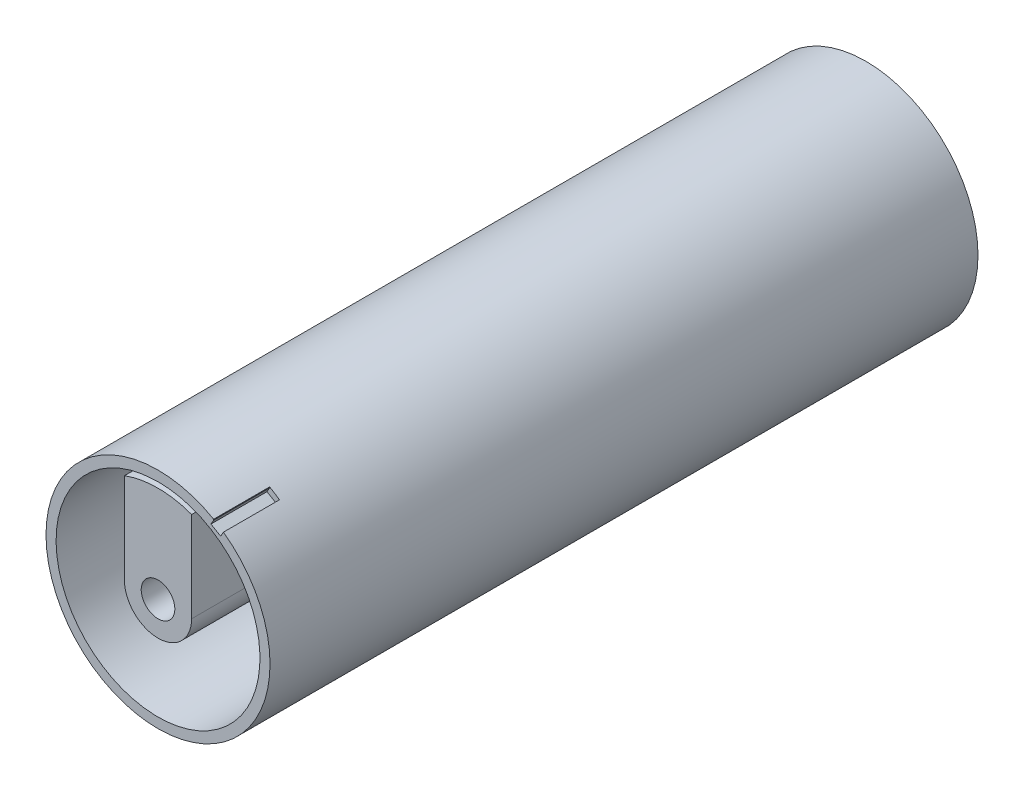
ISO-10303-21;
HEADER;
FILE_DESCRIPTION(('STEP AP214'),'2;1');
FILE_NAME('part.step','',(''),(''),'','','');
FILE_SCHEMA(('AUTOMOTIVE_DESIGN { 1 0 10303 214 1 1 1 1 }'));
ENDSEC;
DATA;
#1=APPLICATION_CONTEXT('core data for automotive mechanical design processes');
#2=APPLICATION_PROTOCOL_DEFINITION('international standard','automotive_design',2000,#1);
#3=PRODUCT_CONTEXT('',#1,'mechanical');
#4=PRODUCT('Part','Part','',(#3));
#5=PRODUCT_RELATED_PRODUCT_CATEGORY('part','',(#4));
#6=PRODUCT_DEFINITION_FORMATION('','',#4);
#7=PRODUCT_DEFINITION_CONTEXT('part definition',#1,'design');
#8=PRODUCT_DEFINITION('design','',#6,#7);
#9=PRODUCT_DEFINITION_SHAPE('','',#8);
#10=(LENGTH_UNIT() NAMED_UNIT(*) SI_UNIT(.MILLI.,.METRE.));
#11=(NAMED_UNIT(*) PLANE_ANGLE_UNIT() SI_UNIT($,.RADIAN.));
#12=(NAMED_UNIT(*) SI_UNIT($,.STERADIAN.) SOLID_ANGLE_UNIT());
#13=UNCERTAINTY_MEASURE_WITH_UNIT(LENGTH_MEASURE(1.E-05),#10,'distance_accuracy_value','');
#14=(GEOMETRIC_REPRESENTATION_CONTEXT(3) GLOBAL_UNCERTAINTY_ASSIGNED_CONTEXT((#13)) GLOBAL_UNIT_ASSIGNED_CONTEXT((#10,
#11,#12)) REPRESENTATION_CONTEXT('',''));
#15=CARTESIAN_POINT('',(0.,0.,0.));
#16=DIRECTION('',(0.,0.,1.));
#17=DIRECTION('',(1.,0.,0.));
#18=AXIS2_PLACEMENT_3D('',#15,#16,#17);
#19=CARTESIAN_POINT('',(0.,0.,41.2802756522968));
#20=DIRECTION('',(0.,0.,1.));
#21=DIRECTION('',(1.,0.,0.));
#22=AXIS2_PLACEMENT_3D('',#19,#20,#21);
#23=CYLINDRICAL_SURFACE('',#22,6.);
#24=DIRECTION('',(0.,0.,1.));
#25=VECTOR('',#24,1.);
#26=CARTESIAN_POINT('',(-6.,0.,41.2802756522968));
#27=LINE('',#26,#25);
#28=CARTESIAN_POINT('',(-6.,0.,67.8));
#29=VERTEX_POINT('',#28);
#30=CARTESIAN_POINT('',(-6.,0.,126.4));
#31=VERTEX_POINT('',#30);
#32=EDGE_CURVE('E102',#29,#31,#27,.T.);
#33=ORIENTED_EDGE('',*,*,#32,.F.);
#34=CARTESIAN_POINT('',(0.,0.,67.8));
#35=DIRECTION('',(0.,0.,-1.));
#36=DIRECTION('',(-1.,0.,0.));
#37=AXIS2_PLACEMENT_3D('',#34,#35,#36);
#38=CIRCLE('',#37,6.);
#39=CARTESIAN_POINT('',(6.,0.,67.8));
#40=VERTEX_POINT('',#39);
#41=EDGE_CURVE('E92',#29,#40,#38,.F.);
#42=ORIENTED_EDGE('',*,*,#41,.T.);
#43=DIRECTION('',(0.,0.,1.));
#44=VECTOR('',#43,1.);
#45=CARTESIAN_POINT('',(6.,0.,41.2802756522968));
#46=LINE('',#45,#44);
#47=CARTESIAN_POINT('',(6.,0.,126.4));
#48=VERTEX_POINT('',#47);
#49=EDGE_CURVE('E57',#40,#48,#46,.T.);
#50=ORIENTED_EDGE('',*,*,#49,.T.);
#51=CARTESIAN_POINT('',(0.,0.,126.4));
#52=DIRECTION('',(0.,0.,1.));
#53=DIRECTION('',(-1.,0.,0.));
#54=AXIS2_PLACEMENT_3D('',#51,#52,#53);
#55=CIRCLE('',#54,6.);
#56=EDGE_CURVE('E104',#31,#48,#55,.T.);
#57=ORIENTED_EDGE('',*,*,#56,.F.);
#58=EDGE_LOOP('',(#33,#42,#50,#57));
#59=FACE_BOUND('',#58,.T.);
#60=ADVANCED_FACE('F53',(#59),#23,.T.);
#61=CARTESIAN_POINT('',(-6.,16.1195533436879,41.2802756522968));
#62=DIRECTION('',(-1.,0.,0.));
#63=DIRECTION('',(0.,-1.,0.));
#64=AXIS2_PLACEMENT_3D('',#61,#62,#63);
#65=PLANE('',#64);
#66=DIRECTION('',(0.,0.,1.));
#67=VECTOR('',#66,1.);
#68=CARTESIAN_POINT('',(-6.,16.1195533436879,41.2802756522968));
#69=LINE('',#68,#67);
#70=CARTESIAN_POINT('',(-6.,16.1195533436879,67.8));
#71=VERTEX_POINT('',#70);
#72=CARTESIAN_POINT('',(-6.,16.1195533436879,126.4));
#73=VERTEX_POINT('',#72);
#74=EDGE_CURVE('E110',#71,#73,#69,.T.);
#75=ORIENTED_EDGE('',*,*,#74,.F.);
#76=DIRECTION('',(0.,-1.,0.));
#77=VECTOR('',#76,1.);
#78=CARTESIAN_POINT('',(-6.,16.1195533436879,67.8));
#79=LINE('',#78,#77);
#80=EDGE_CURVE('E96',#71,#29,#79,.T.);
#81=ORIENTED_EDGE('',*,*,#80,.T.);
#82=ORIENTED_EDGE('',*,*,#32,.T.);
#83=DIRECTION('',(0.,-1.,0.));
#84=VECTOR('',#83,1.);
#85=CARTESIAN_POINT('',(-6.,16.1195533436879,126.4));
#86=LINE('',#85,#84);
#87=EDGE_CURVE('E62',#73,#31,#86,.T.);
#88=ORIENTED_EDGE('',*,*,#87,.F.);
#89=EDGE_LOOP('',(#75,#81,#82,#88));
#90=FACE_BOUND('',#89,.T.);
#91=ADVANCED_FACE('F109',(#90),#65,.T.);
#92=CARTESIAN_POINT('',(0.,0.,41.2802756522968));
#93=DIRECTION('',(0.,0.,1.));
#94=DIRECTION('',(1.,0.,0.));
#95=AXIS2_PLACEMENT_3D('',#92,#93,#94);
#96=CYLINDRICAL_SURFACE('',#95,17.2);
#97=DIRECTION('',(0.,0.,1.));
#98=VECTOR('',#97,1.);
#99=CARTESIAN_POINT('',(6.,16.1195533436879,41.2802756522968));
#100=LINE('',#99,#98);
#101=CARTESIAN_POINT('',(6.,16.1195533436879,67.8));
#102=VERTEX_POINT('',#101);
#103=CARTESIAN_POINT('',(6.,16.1195533436879,126.4));
#104=VERTEX_POINT('',#103);
#105=EDGE_CURVE('E115',#102,#104,#100,.T.);
#106=ORIENTED_EDGE('',*,*,#105,.F.);
#107=CARTESIAN_POINT('',(0.,0.,67.8));
#108=DIRECTION('',(0.,0.,-1.));
#109=DIRECTION('',(-1.,0.,0.));
#110=AXIS2_PLACEMENT_3D('',#107,#108,#109);
#111=CIRCLE('',#110,17.2);
#112=EDGE_CURVE('E76',#102,#71,#111,.F.);
#113=ORIENTED_EDGE('',*,*,#112,.T.);
#114=ORIENTED_EDGE('',*,*,#74,.T.);
#115=CARTESIAN_POINT('',(0.,0.,126.4));
#116=DIRECTION('',(0.,0.,1.));
#117=DIRECTION('',(1.,0.,0.));
#118=AXIS2_PLACEMENT_3D('',#115,#116,#117);
#119=CIRCLE('',#118,17.2);
#120=EDGE_CURVE('E127',#104,#73,#119,.T.);
#121=ORIENTED_EDGE('',*,*,#120,.F.);
#122=EDGE_LOOP('',(#106,#113,#114,#121));
#123=FACE_BOUND('',#122,.T.);
#124=ADVANCED_FACE('F133',(#123),#96,.T.);
#125=CARTESIAN_POINT('',(6.,0.,41.2802756522968));
#126=DIRECTION('',(1.,0.,0.));
#127=DIRECTION('',(0.,1.,0.));
#128=AXIS2_PLACEMENT_3D('',#125,#126,#127);
#129=PLANE('',#128);
#130=ORIENTED_EDGE('',*,*,#49,.F.);
#131=DIRECTION('',(0.,1.,0.));
#132=VECTOR('',#131,1.);
#133=CARTESIAN_POINT('',(6.,0.,67.8));
#134=LINE('',#133,#132);
#135=EDGE_CURVE('E70',#40,#102,#134,.T.);
#136=ORIENTED_EDGE('',*,*,#135,.T.);
#137=ORIENTED_EDGE('',*,*,#105,.T.);
#138=DIRECTION('',(0.,1.,0.));
#139=VECTOR('',#138,1.);
#140=CARTESIAN_POINT('',(6.,0.,126.4));
#141=LINE('',#140,#139);
#142=EDGE_CURVE('E124',#48,#104,#141,.T.);
#143=ORIENTED_EDGE('',*,*,#142,.F.);
#144=EDGE_LOOP('',(#130,#136,#137,#143));
#145=FACE_BOUND('',#144,.T.);
#146=ADVANCED_FACE('F135',(#145),#129,.T.);
#147=CARTESIAN_POINT('',(0.,0.,41.2802756522968));
#148=DIRECTION('',(0.,0.,1.));
#149=DIRECTION('',(1.,0.,0.));
#150=AXIS2_PLACEMENT_3D('',#147,#148,#149);
#151=CYLINDRICAL_SURFACE('',#150,2.99999999999862);
#152=CARTESIAN_POINT('',(0.,0.,126.4));
#153=DIRECTION('',(0.,0.,1.));
#154=DIRECTION('',(1.,0.,0.));
#155=AXIS2_PLACEMENT_3D('',#152,#153,#154);
#156=CIRCLE('',#155,2.99999999999862);
#157=CARTESIAN_POINT('',(2.99999999999862,0.,126.4));
#158=VERTEX_POINT('',#157);
#159=EDGE_CURVE('E116',#158,#158,#156,.T.);
#160=ORIENTED_EDGE('',*,*,#159,.T.);
#161=EDGE_LOOP('',(#160));
#162=FACE_BOUND('',#161,.T.);
#163=CARTESIAN_POINT('',(0.,0.,67.8));
#164=DIRECTION('',(0.,0.,-1.));
#165=DIRECTION('',(-1.,0.,0.));
#166=AXIS2_PLACEMENT_3D('',#163,#164,#165);
#167=CIRCLE('',#166,2.99999999999862);
#168=CARTESIAN_POINT('',(-2.99999999999862,0.,67.8));
#169=VERTEX_POINT('',#168);
#170=EDGE_CURVE('E13',#169,#169,#167,.F.);
#171=ORIENTED_EDGE('',*,*,#170,.F.);
#172=EDGE_LOOP('',(#171));
#173=FACE_BOUND('',#172,.T.);
#174=ADVANCED_FACE('F141',(#162,#173),#151,.F.);
#175=CARTESIAN_POINT('',(0.,0.,126.4));
#176=DIRECTION('',(0.,0.,-1.));
#177=DIRECTION('',(-1.,0.,0.));
#178=AXIS2_PLACEMENT_3D('',#175,#176,#177);
#179=PLANE('',#178);
#180=ORIENTED_EDGE('',*,*,#159,.F.);
#181=EDGE_LOOP('',(#180));
#182=FACE_BOUND('',#181,.T.);
#183=ORIENTED_EDGE('',*,*,#56,.T.);
#184=ORIENTED_EDGE('',*,*,#142,.T.);
#185=ORIENTED_EDGE('',*,*,#120,.T.);
#186=ORIENTED_EDGE('',*,*,#87,.T.);
#187=EDGE_LOOP('',(#183,#184,#185,#186));
#188=FACE_BOUND('',#187,.T.);
#189=ADVANCED_FACE('F131',(#182,#188),#179,.F.);
#190=CARTESIAN_POINT('',(0.,0.,67.8));
#191=DIRECTION('',(0.,0.,-1.));
#192=DIRECTION('',(-1.,0.,0.));
#193=AXIS2_PLACEMENT_3D('',#190,#191,#192);
#194=PLANE('',#193);
#195=ORIENTED_EDGE('',*,*,#41,.F.);
#196=ORIENTED_EDGE('',*,*,#80,.F.);
#197=ORIENTED_EDGE('',*,*,#112,.F.);
#198=ORIENTED_EDGE('',*,*,#135,.F.);
#199=EDGE_LOOP('',(#195,#196,#197,#198));
#200=FACE_BOUND('',#199,.T.);
#201=ORIENTED_EDGE('',*,*,#170,.T.);
#202=EDGE_LOOP('',(#201));
#203=FACE_BOUND('',#202,.T.);
#204=ADVANCED_FACE('F55',(#200,#203),#194,.T.);
#205=CLOSED_SHELL('',(#60,#91,#124,#146,#174,#189,#204));
#206=MANIFOLD_SOLID_BREP('B2',#205);
#207=CARTESIAN_POINT('',(-7.43302302226797,8.1086477757043,126.4));
#208=DIRECTION('',(0.,0.,-1.));
#209=DIRECTION('',(-1.,0.,0.));
#210=AXIS2_PLACEMENT_3D('',#207,#208,#209);
#211=CYLINDRICAL_SURFACE('',#210,6.);
#212=CARTESIAN_POINT('',(-7.43302302226797,8.1086477757043,67.4));
#213=DIRECTION('',(0.,0.,-1.));
#214=DIRECTION('',(-1.,0.,0.));
#215=AXIS2_PLACEMENT_3D('',#212,#213,#214);
#216=CIRCLE('',#215,6.);
#217=CARTESIAN_POINT('',(-1.51453491696668,9.09429403446407,67.4));
#218=VERTEX_POINT('',#217);
#219=CARTESIAN_POINT('',(-3.37864682830362,3.6857489889565,67.4));
#220=VERTEX_POINT('',#219);
#221=EDGE_CURVE('E345',#218,#220,#216,.T.);
#222=ORIENTED_EDGE('',*,*,#221,.F.);
#223=DIRECTION('',(0.,0.,-1.));
#224=VECTOR('',#223,1.);
#225=CARTESIAN_POINT('',(-1.51453491696668,9.09429403446407,126.4));
#226=LINE('',#225,#224);
#227=CARTESIAN_POINT('',(-1.51453491696668,9.09429403446407,59.));
#228=VERTEX_POINT('',#227);
#229=EDGE_CURVE('E222',#218,#228,#226,.T.);
#230=ORIENTED_EDGE('',*,*,#229,.T.);
#231=CARTESIAN_POINT('',(-7.43302302226797,8.1086477757043,59.));
#232=DIRECTION('',(0.,0.,-1.));
#233=DIRECTION('',(-1.,0.,0.));
#234=AXIS2_PLACEMENT_3D('',#231,#232,#233);
#235=CIRCLE('',#234,6.);
#236=CARTESIAN_POINT('',(-3.37864682830362,3.6857489889565,59.));
#237=VERTEX_POINT('',#236);
#238=EDGE_CURVE('E367',#228,#237,#235,.T.);
#239=ORIENTED_EDGE('',*,*,#238,.T.);
#240=DIRECTION('',(0.,0.,-1.));
#241=VECTOR('',#240,1.);
#242=CARTESIAN_POINT('',(-3.37864682830362,3.6857489889565,126.4));
#243=LINE('',#242,#241);
#244=EDGE_CURVE('E378',#220,#237,#243,.T.);
#245=ORIENTED_EDGE('',*,*,#244,.F.);
#246=EDGE_LOOP('',(#222,#230,#239,#245));
#247=FACE_BOUND('',#246,.T.);
#248=ADVANCED_FACE('F199',(#247),#211,.F.);
#249=CARTESIAN_POINT('',(0.,0.,126.4));
#250=DIRECTION('',(0.,0.,-1.));
#251=DIRECTION('',(-1.,0.,0.));
#252=AXIS2_PLACEMENT_3D('',#249,#250,#251);
#253=CYLINDRICAL_SURFACE('',#252,5.);
#254=CARTESIAN_POINT('',(0.,0.,67.4));
#255=DIRECTION('',(0.,0.,-1.));
#256=DIRECTION('',(-1.,0.,0.));
#257=AXIS2_PLACEMENT_3D('',#254,#255,#256);
#258=CIRCLE('',#257,5.);
#259=CARTESIAN_POINT('',(2.72727272727273,4.19070202604222,67.4));
#260=VERTEX_POINT('',#259);
#261=EDGE_CURVE('E347',#220,#260,#258,.F.);
#262=ORIENTED_EDGE('',*,*,#261,.F.);
#263=ORIENTED_EDGE('',*,*,#244,.T.);
#264=CARTESIAN_POINT('',(0.,0.,59.));
#265=DIRECTION('',(0.,0.,-1.));
#266=DIRECTION('',(-1.,0.,0.));
#267=AXIS2_PLACEMENT_3D('',#264,#265,#266);
#268=CIRCLE('',#267,5.);
#269=CARTESIAN_POINT('',(2.72727272727273,4.19070202604222,59.));
#270=VERTEX_POINT('',#269);
#271=EDGE_CURVE('E369',#237,#270,#268,.F.);
#272=ORIENTED_EDGE('',*,*,#271,.T.);
#273=DIRECTION('',(0.,0.,-1.));
#274=VECTOR('',#273,1.);
#275=CARTESIAN_POINT('',(2.72727272727273,4.19070202604222,126.4));
#276=LINE('',#275,#274);
#277=EDGE_CURVE('E381',#260,#270,#276,.T.);
#278=ORIENTED_EDGE('',*,*,#277,.F.);
#279=EDGE_LOOP('',(#262,#263,#272,#278));
#280=FACE_BOUND('',#279,.T.);
#281=ADVANCED_FACE('F426',(#280),#253,.T.);
#282=CARTESIAN_POINT('',(6.,9.21954445729289,126.4));
#283=DIRECTION('',(0.,0.,-1.));
#284=DIRECTION('',(-1.,0.,0.));
#285=AXIS2_PLACEMENT_3D('',#282,#283,#284);
#286=CYLINDRICAL_SURFACE('',#285,6.);
#287=CARTESIAN_POINT('',(6.,9.21954445729289,67.4));
#288=DIRECTION('',(0.,0.,-1.));
#289=DIRECTION('',(-1.,0.,0.));
#290=AXIS2_PLACEMENT_3D('',#287,#288,#289);
#291=CIRCLE('',#290,6.);
#292=CARTESIAN_POINT('',(0.,9.21954445729289,67.4));
#293=VERTEX_POINT('',#292);
#294=EDGE_CURVE('E349',#260,#293,#291,.T.);
#295=ORIENTED_EDGE('',*,*,#294,.F.);
#296=ORIENTED_EDGE('',*,*,#277,.T.);
#297=CARTESIAN_POINT('',(6.,9.21954445729289,59.));
#298=DIRECTION('',(0.,0.,-1.));
#299=DIRECTION('',(-1.,0.,0.));
#300=AXIS2_PLACEMENT_3D('',#297,#298,#299);
#301=CIRCLE('',#300,6.);
#302=CARTESIAN_POINT('',(0.,9.21954445729289,59.));
#303=VERTEX_POINT('',#302);
#304=EDGE_CURVE('E372',#270,#303,#301,.T.);
#305=ORIENTED_EDGE('',*,*,#304,.T.);
#306=DIRECTION('',(0.,0.,-1.));
#307=VECTOR('',#306,1.);
#308=CARTESIAN_POINT('',(0.,9.21954445729289,126.4));
#309=LINE('',#308,#307);
#310=EDGE_CURVE('E383',#293,#303,#309,.T.);
#311=ORIENTED_EDGE('',*,*,#310,.F.);
#312=EDGE_LOOP('',(#295,#296,#305,#311));
#313=FACE_BOUND('',#312,.T.);
#314=ADVANCED_FACE('F431',(#313),#286,.F.);
#315=CARTESIAN_POINT('',(0.,18.2,126.4));
#316=DIRECTION('',(1.,0.,0.));
#317=DIRECTION('',(0.,1.,0.));
#318=AXIS2_PLACEMENT_3D('',#315,#316,#317);
#319=PLANE('',#318);
#320=DIRECTION('',(0.,1.,0.));
#321=VECTOR('',#320,1.);
#322=CARTESIAN_POINT('',(0.,18.2,67.4));
#323=LINE('',#322,#321);
#324=CARTESIAN_POINT('',(0.,18.2,67.4));
#325=VERTEX_POINT('',#324);
#326=EDGE_CURVE('E351',#293,#325,#323,.T.);
#327=ORIENTED_EDGE('',*,*,#326,.F.);
#328=ORIENTED_EDGE('',*,*,#310,.T.);
#329=DIRECTION('',(0.,1.,0.));
#330=VECTOR('',#329,1.);
#331=CARTESIAN_POINT('',(0.,18.2,59.));
#332=LINE('',#331,#330);
#333=CARTESIAN_POINT('',(0.,18.2,59.));
#334=VERTEX_POINT('',#333);
#335=EDGE_CURVE('E375',#303,#334,#332,.T.);
#336=ORIENTED_EDGE('',*,*,#335,.T.);
#337=DIRECTION('',(0.,0.,-1.));
#338=VECTOR('',#337,1.);
#339=CARTESIAN_POINT('',(0.,18.2,126.4));
#340=LINE('',#339,#338);
#341=EDGE_CURVE('E388',#325,#334,#340,.T.);
#342=ORIENTED_EDGE('',*,*,#341,.F.);
#343=EDGE_LOOP('',(#327,#328,#336,#342));
#344=FACE_BOUND('',#343,.T.);
#345=ADVANCED_FACE('F469',(#344),#319,.T.);
#346=CARTESIAN_POINT('',(-2.98979365157129,17.9527472527473,126.4));
#347=DIRECTION('',(-0.986414684216882,-0.164274376459961,0.));
#348=DIRECTION('',(0.164274376459961,-0.986414684216882,0.));
#349=AXIS2_PLACEMENT_3D('',#346,#347,#348);
#350=PLANE('',#349);
#351=DIRECTION('',(0.164274376459961,-0.986414684216882,0.));
#352=VECTOR('',#351,1.);
#353=CARTESIAN_POINT('',(-2.98979365157129,17.9527472527473,67.4));
#354=LINE('',#353,#352);
#355=CARTESIAN_POINT('',(-2.98979365157129,17.9527472527473,67.4));
#356=VERTEX_POINT('',#355);
#357=EDGE_CURVE('E343',#356,#218,#354,.T.);
#358=ORIENTED_EDGE('',*,*,#357,.F.);
#359=DIRECTION('',(0.,0.,-1.));
#360=VECTOR('',#359,1.);
#361=CARTESIAN_POINT('',(-2.98979365157129,17.9527472527473,126.4));
#362=LINE('',#361,#360);
#363=CARTESIAN_POINT('',(-2.98979365157129,17.9527472527473,59.));
#364=VERTEX_POINT('',#363);
#365=EDGE_CURVE('E391',#356,#364,#362,.T.);
#366=ORIENTED_EDGE('',*,*,#365,.T.);
#367=DIRECTION('',(0.164274376459961,-0.986414684216882,0.));
#368=VECTOR('',#367,1.);
#369=CARTESIAN_POINT('',(-2.98979365157129,17.9527472527473,59.));
#370=LINE('',#369,#368);
#371=EDGE_CURVE('E364',#364,#228,#370,.T.);
#372=ORIENTED_EDGE('',*,*,#371,.T.);
#373=ORIENTED_EDGE('',*,*,#229,.F.);
#374=EDGE_LOOP('',(#358,#366,#372,#373));
#375=FACE_BOUND('',#374,.T.);
#376=ADVANCED_FACE('F436',(#375),#350,.T.);
#377=CARTESIAN_POINT('',(0.,0.,126.4));
#378=DIRECTION('',(0.,0.,-1.));
#379=DIRECTION('',(-1.,0.,0.));
#380=AXIS2_PLACEMENT_3D('',#377,#378,#379);
#381=CYLINDRICAL_SURFACE('',#380,3.);
#382=CARTESIAN_POINT('',(0.,0.,67.4));
#383=DIRECTION('',(0.,0.,-1.));
#384=DIRECTION('',(-1.,0.,0.));
#385=AXIS2_PLACEMENT_3D('',#382,#383,#384);
#386=CIRCLE('',#385,3.);
#387=CARTESIAN_POINT('',(-3.,0.,67.4));
#388=VERTEX_POINT('',#387);
#389=EDGE_CURVE('E339',#388,#388,#386,.F.);
#390=ORIENTED_EDGE('',*,*,#389,.T.);
#391=EDGE_LOOP('',(#390));
#392=FACE_BOUND('',#391,.T.);
#393=CARTESIAN_POINT('',(0.,0.,59.));
#394=DIRECTION('',(0.,0.,-1.));
#395=DIRECTION('',(-1.,0.,0.));
#396=AXIS2_PLACEMENT_3D('',#393,#394,#395);
#397=CIRCLE('',#396,3.);
#398=CARTESIAN_POINT('',(-3.,0.,59.));
#399=VERTEX_POINT('',#398);
#400=EDGE_CURVE('E362',#399,#399,#397,.F.);
#401=ORIENTED_EDGE('',*,*,#400,.F.);
#402=EDGE_LOOP('',(#401));
#403=FACE_BOUND('',#402,.T.);
#404=ADVANCED_FACE('F445',(#392,#403),#381,.F.);
#405=CARTESIAN_POINT('',(0.,0.,126.4));
#406=DIRECTION('',(0.,0.,1.));
#407=DIRECTION('',(1.,0.,0.));
#408=AXIS2_PLACEMENT_3D('',#405,#406,#407);
#409=PLANE('',#408);
#410=CARTESIAN_POINT('',(11.2461466911154,17.4788974583847,126.4));
#411=DIRECTION('',(0.,0.,1.));
#412=DIRECTION('',(-1.,0.,0.));
#413=AXIS2_PLACEMENT_3D('',#410,#411,#412);
#414=CIRCLE('',#413,1.31926101883655);
#415=CARTESIAN_POINT('',(9.93230749580875,17.3594143855345,126.4));
#416=VERTEX_POINT('',#415);
#417=CARTESIAN_POINT('',(9.94987437106604,17.2336879396141,126.4));
#418=VERTEX_POINT('',#417);
#419=EDGE_CURVE('E309',#416,#418,#414,.T.);
#420=ORIENTED_EDGE('',*,*,#419,.F.);
#421=CARTESIAN_POINT('',(0.,0.,126.4));
#422=DIRECTION('',(0.,0.,1.));
#423=DIRECTION('',(1.,0.,0.));
#424=AXIS2_PLACEMENT_3D('',#421,#422,#423);
#425=CIRCLE('',#424,20.);
#426=CARTESIAN_POINT('',(11.681925178635,16.2336879396142,126.4));
#427=VERTEX_POINT('',#426);
#428=EDGE_CURVE('E399',#416,#427,#425,.T.);
#429=ORIENTED_EDGE('',*,*,#428,.T.);
#430=DIRECTION('',(0.499999999999995,0.866025403784442,0.));
#431=VECTOR('',#430,1.);
#432=CARTESIAN_POINT('',(11.181925178635,15.3676625358297,126.4));
#433=LINE('',#432,#431);
#434=CARTESIAN_POINT('',(11.181925178635,15.3676625358297,126.4));
#435=VERTEX_POINT('',#434);
#436=EDGE_CURVE('E303',#435,#427,#433,.T.);
#437=ORIENTED_EDGE('',*,*,#436,.F.);
#438=DIRECTION('',(0.86602540378446,-0.499999999999963,0.));
#439=VECTOR('',#438,1.);
#440=CARTESIAN_POINT('',(9.44987437106605,16.3676625358296,126.4));
#441=LINE('',#440,#439);
#442=CARTESIAN_POINT('',(9.44987437106605,16.3676625358296,126.4));
#443=VERTEX_POINT('',#442);
#444=EDGE_CURVE('E325',#443,#435,#441,.T.);
#445=ORIENTED_EDGE('',*,*,#444,.F.);
#446=DIRECTION('',(-0.499999999999993,-0.866025403784442,0.));
#447=VECTOR('',#446,1.);
#448=CARTESIAN_POINT('',(9.94987437106604,17.2336879396141,126.4));
#449=LINE('',#448,#447);
#450=EDGE_CURVE('E323',#418,#443,#449,.T.);
#451=ORIENTED_EDGE('',*,*,#450,.F.);
#452=EDGE_LOOP('',(#420,#429,#437,#445,#451));
#453=FACE_BOUND('',#452,.T.);
#454=DIRECTION('',(-0.996597883857096,-0.082417582417583,0.));
#455=VECTOR('',#454,1.);
#456=CARTESIAN_POINT('',(0.,18.2,126.4));
#457=LINE('',#456,#455);
#458=CARTESIAN_POINT('',(0.,18.2,126.4));
#459=VERTEX_POINT('',#458);
#460=CARTESIAN_POINT('',(-2.98979365157129,17.9527472527473,126.4));
#461=VERTEX_POINT('',#460);
#462=EDGE_CURVE('E332',#459,#461,#457,.T.);
#463=ORIENTED_EDGE('',*,*,#462,.F.);
#464=CARTESIAN_POINT('',(0.,0.,126.4));
#465=DIRECTION('',(0.,0.,1.));
#466=DIRECTION('',(1.,0.,0.));
#467=AXIS2_PLACEMENT_3D('',#464,#465,#466);
#468=CIRCLE('',#467,18.2);
#469=EDGE_CURVE('E393',#461,#459,#468,.T.);
#470=ORIENTED_EDGE('',*,*,#469,.F.);
#471=EDGE_LOOP('',(#463,#470));
#472=FACE_BOUND('',#471,.T.);
#473=ADVANCED_FACE('F409',(#453,#472),#409,.T.);
#474=CARTESIAN_POINT('',(0.,0.,0.));
#475=DIRECTION('',(0.,0.,1.));
#476=DIRECTION('',(1.,0.,0.));
#477=AXIS2_PLACEMENT_3D('',#474,#475,#476);
#478=PLANE('',#477);
#479=CARTESIAN_POINT('',(0.,0.,0.));
#480=DIRECTION('',(0.,0.,1.));
#481=DIRECTION('',(1.,0.,0.));
#482=AXIS2_PLACEMENT_3D('',#479,#480,#481);
#483=CIRCLE('',#482,20.);
#484=CARTESIAN_POINT('',(20.,0.,0.));
#485=VERTEX_POINT('',#484);
#486=EDGE_CURVE('E396',#485,#485,#483,.T.);
#487=ORIENTED_EDGE('',*,*,#486,.F.);
#488=EDGE_LOOP('',(#487));
#489=FACE_BOUND('',#488,.T.);
#490=CARTESIAN_POINT('',(0.,0.,0.));
#491=DIRECTION('',(0.,0.,1.));
#492=DIRECTION('',(1.,0.,0.));
#493=AXIS2_PLACEMENT_3D('',#490,#491,#492);
#494=CIRCLE('',#493,18.2);
#495=CARTESIAN_POINT('',(-2.98979365157129,17.9527472527473,0.));
#496=VERTEX_POINT('',#495);
#497=CARTESIAN_POINT('',(0.,18.2,0.));
#498=VERTEX_POINT('',#497);
#499=EDGE_CURVE('E380',#496,#498,#494,.T.);
#500=ORIENTED_EDGE('',*,*,#499,.T.);
#501=DIRECTION('',(0.996597883857096,0.0824175824175819,0.));
#502=VECTOR('',#501,1.);
#503=CARTESIAN_POINT('',(0.,18.2,0.));
#504=LINE('',#503,#502);
#505=EDGE_CURVE('E353',#496,#498,#504,.T.);
#506=ORIENTED_EDGE('',*,*,#505,.F.);
#507=EDGE_LOOP('',(#500,#506));
#508=FACE_BOUND('',#507,.T.);
#509=ADVANCED_FACE('F444',(#489,#508),#478,.F.);
#510=CARTESIAN_POINT('',(0.,0.,126.4));
#511=DIRECTION('',(0.,0.,-1.));
#512=DIRECTION('',(-1.,0.,0.));
#513=AXIS2_PLACEMENT_3D('',#510,#511,#512);
#514=CYLINDRICAL_SURFACE('',#513,20.);
#515=ORIENTED_EDGE('',*,*,#428,.F.);
#516=DIRECTION('',(0.,0.,1.));
#517=VECTOR('',#516,1.);
#518=CARTESIAN_POINT('',(9.93230749580876,17.3594143855345,121.4));
#519=LINE('',#518,#517);
#520=CARTESIAN_POINT('',(9.93230749580875,17.3594143855345,116.4));
#521=VERTEX_POINT('',#520);
#522=EDGE_CURVE('E51',#416,#521,#519,.F.);
#523=ORIENTED_EDGE('',*,*,#522,.T.);
#524=CARTESIAN_POINT('',(0.,0.,116.4));
#525=DIRECTION('',(0.,0.,-1.));
#526=DIRECTION('',(-1.,0.,0.));
#527=AXIS2_PLACEMENT_3D('',#524,#525,#526);
#528=CIRCLE('',#527,20.);
#529=CARTESIAN_POINT('',(11.681925178635,16.2336879396142,116.4));
#530=VERTEX_POINT('',#529);
#531=EDGE_CURVE('E207',#521,#530,#528,.T.);
#532=ORIENTED_EDGE('',*,*,#531,.T.);
#533=DIRECTION('',(0.,0.,1.));
#534=VECTOR('',#533,1.);
#535=CARTESIAN_POINT('',(11.681925178635,16.2336879396142,116.4));
#536=LINE('',#535,#534);
#537=EDGE_CURVE('E329',#530,#427,#536,.T.);
#538=ORIENTED_EDGE('',*,*,#537,.T.);
#539=EDGE_LOOP('',(#515,#523,#532,#538));
#540=FACE_BOUND('',#539,.T.);
#541=ORIENTED_EDGE('',*,*,#486,.T.);
#542=EDGE_LOOP('',(#541));
#543=FACE_BOUND('',#542,.T.);
#544=ADVANCED_FACE('F201',(#540,#543),#514,.T.);
#545=CARTESIAN_POINT('',(0.,0.,126.4));
#546=DIRECTION('',(0.,0.,-1.));
#547=DIRECTION('',(-1.,0.,0.));
#548=AXIS2_PLACEMENT_3D('',#545,#546,#547);
#549=CYLINDRICAL_SURFACE('',#548,18.2);
#550=ORIENTED_EDGE('',*,*,#365,.F.);
#551=EDGE_CURVE('E389',#461,#356,#362,.T.);
#552=ORIENTED_EDGE('',*,*,#551,.F.);
#553=ORIENTED_EDGE('',*,*,#469,.T.);
#554=EDGE_CURVE('E385',#459,#325,#340,.T.);
#555=ORIENTED_EDGE('',*,*,#554,.T.);
#556=ORIENTED_EDGE('',*,*,#341,.T.);
#557=DIRECTION('',(0.,0.,-1.));
#558=VECTOR('',#557,1.);
#559=CARTESIAN_POINT('',(0.,18.2,59.));
#560=LINE('',#559,#558);
#561=EDGE_CURVE('E359',#334,#498,#560,.T.);
#562=ORIENTED_EDGE('',*,*,#561,.T.);
#563=ORIENTED_EDGE('',*,*,#499,.F.);
#564=DIRECTION('',(0.,0.,-1.));
#565=VECTOR('',#564,1.);
#566=CARTESIAN_POINT('',(-2.98979365157129,17.9527472527473,59.));
#567=LINE('',#566,#565);
#568=EDGE_CURVE('E357',#364,#496,#567,.T.);
#569=ORIENTED_EDGE('',*,*,#568,.F.);
#570=EDGE_LOOP('',(#550,#552,#553,#555,#556,#562,#563,#569));
#571=FACE_BOUND('',#570,.T.);
#572=ADVANCED_FACE('F438',(#571),#549,.F.);
#573=CARTESIAN_POINT('',(0.,0.,59.));
#574=DIRECTION('',(0.,0.,-1.));
#575=DIRECTION('',(-1.,0.,0.));
#576=AXIS2_PLACEMENT_3D('',#573,#574,#575);
#577=PLANE('',#576);
#578=ORIENTED_EDGE('',*,*,#304,.F.);
#579=ORIENTED_EDGE('',*,*,#271,.F.);
#580=ORIENTED_EDGE('',*,*,#238,.F.);
#581=ORIENTED_EDGE('',*,*,#371,.F.);
#582=DIRECTION('',(0.996597883857096,0.0824175824175819,0.));
#583=VECTOR('',#582,1.);
#584=CARTESIAN_POINT('',(0.,18.2,59.));
#585=LINE('',#584,#583);
#586=EDGE_CURVE('E354',#364,#334,#585,.T.);
#587=ORIENTED_EDGE('',*,*,#586,.T.);
#588=ORIENTED_EDGE('',*,*,#335,.F.);
#589=EDGE_LOOP('',(#578,#579,#580,#581,#587,#588));
#590=FACE_BOUND('',#589,.T.);
#591=ORIENTED_EDGE('',*,*,#400,.T.);
#592=EDGE_LOOP('',(#591));
#593=FACE_BOUND('',#592,.T.);
#594=ADVANCED_FACE('F441',(#590,#593),#577,.T.);
#595=CARTESIAN_POINT('',(0.,18.2,59.));
#596=DIRECTION('',(-0.0824175824175819,0.996597883857096,0.));
#597=DIRECTION('',(-0.996597883857096,-0.0824175824175819,0.));
#598=AXIS2_PLACEMENT_3D('',#595,#596,#597);
#599=PLANE('',#598);
#600=ORIENTED_EDGE('',*,*,#505,.T.);
#601=ORIENTED_EDGE('',*,*,#561,.F.);
#602=ORIENTED_EDGE('',*,*,#586,.F.);
#603=ORIENTED_EDGE('',*,*,#568,.T.);
#604=EDGE_LOOP('',(#600,#601,#602,#603));
#605=FACE_BOUND('',#604,.T.);
#606=ADVANCED_FACE('F461',(#605),#599,.F.);
#607=CARTESIAN_POINT('',(0.,0.,67.4));
#608=DIRECTION('',(0.,0.,-1.));
#609=DIRECTION('',(-1.,0.,0.));
#610=AXIS2_PLACEMENT_3D('',#607,#608,#609);
#611=PLANE('',#610);
#612=ORIENTED_EDGE('',*,*,#326,.T.);
#613=DIRECTION('',(-0.996597883857096,-0.082417582417583,0.));
#614=VECTOR('',#613,1.);
#615=CARTESIAN_POINT('',(0.,18.2,67.4));
#616=LINE('',#615,#614);
#617=EDGE_CURVE('E336',#325,#356,#616,.T.);
#618=ORIENTED_EDGE('',*,*,#617,.T.);
#619=ORIENTED_EDGE('',*,*,#357,.T.);
#620=ORIENTED_EDGE('',*,*,#221,.T.);
#621=ORIENTED_EDGE('',*,*,#261,.T.);
#622=ORIENTED_EDGE('',*,*,#294,.T.);
#623=EDGE_LOOP('',(#612,#618,#619,#620,#621,#622));
#624=FACE_BOUND('',#623,.T.);
#625=ORIENTED_EDGE('',*,*,#389,.F.);
#626=EDGE_LOOP('',(#625));
#627=FACE_BOUND('',#626,.T.);
#628=ADVANCED_FACE('F486',(#624,#627),#611,.F.);
#629=CARTESIAN_POINT('',(0.,18.2,67.4));
#630=DIRECTION('',(-0.082417582417583,0.996597883857096,0.));
#631=DIRECTION('',(-0.996597883857096,-0.082417582417583,0.));
#632=AXIS2_PLACEMENT_3D('',#629,#630,#631);
#633=PLANE('',#632);
#634=ORIENTED_EDGE('',*,*,#462,.T.);
#635=ORIENTED_EDGE('',*,*,#551,.T.);
#636=ORIENTED_EDGE('',*,*,#617,.F.);
#637=ORIENTED_EDGE('',*,*,#554,.F.);
#638=EDGE_LOOP('',(#634,#635,#636,#637));
#639=FACE_BOUND('',#638,.T.);
#640=ADVANCED_FACE('F484',(#639),#633,.F.);
#641=CARTESIAN_POINT('',(11.2461466911154,17.4788974583847,116.4));
#642=DIRECTION('',(0.,0.,1.));
#643=DIRECTION('',(1.,0.,0.));
#644=AXIS2_PLACEMENT_3D('',#641,#642,#643);
#645=CYLINDRICAL_SURFACE('',#644,1.31926101883655);
#646=ORIENTED_EDGE('',*,*,#419,.T.);
#647=DIRECTION('',(0.,0.,1.));
#648=VECTOR('',#647,1.);
#649=CARTESIAN_POINT('',(9.94987437106604,17.2336879396141,116.4));
#650=LINE('',#649,#648);
#651=CARTESIAN_POINT('',(9.94987437106604,17.2336879396141,116.4));
#652=VERTEX_POINT('',#651);
#653=EDGE_CURVE('E306',#652,#418,#650,.T.);
#654=ORIENTED_EDGE('',*,*,#653,.F.);
#655=CARTESIAN_POINT('',(11.2461466911154,17.4788974583847,116.4));
#656=DIRECTION('',(0.,0.,1.));
#657=DIRECTION('',(-1.,0.,0.));
#658=AXIS2_PLACEMENT_3D('',#655,#656,#657);
#659=CIRCLE('',#658,1.31926101883655);
#660=EDGE_CURVE('E296',#521,#652,#659,.T.);
#661=ORIENTED_EDGE('',*,*,#660,.F.);
#662=ORIENTED_EDGE('',*,*,#522,.F.);
#663=EDGE_LOOP('',(#646,#654,#661,#662));
#664=FACE_BOUND('',#663,.T.);
#665=ADVANCED_FACE('F307',(#664),#645,.F.);
#666=CARTESIAN_POINT('',(11.2461466911154,17.4788974583847,116.4));
#667=DIRECTION('',(0.,0.,-1.));
#668=DIRECTION('',(-1.,0.,0.));
#669=AXIS2_PLACEMENT_3D('',#666,#667,#668);
#670=PLANE('',#669);
#671=ORIENTED_EDGE('',*,*,#660,.T.);
#672=DIRECTION('',(-0.499999999999993,-0.866025403784442,0.));
#673=VECTOR('',#672,1.);
#674=CARTESIAN_POINT('',(9.94987437106604,17.2336879396141,116.4));
#675=LINE('',#674,#673);
#676=CARTESIAN_POINT('',(9.44987437106605,16.3676625358296,116.4));
#677=VERTEX_POINT('',#676);
#678=EDGE_CURVE('E300',#652,#677,#675,.T.);
#679=ORIENTED_EDGE('',*,*,#678,.T.);
#680=DIRECTION('',(0.86602540378446,-0.499999999999963,0.));
#681=VECTOR('',#680,1.);
#682=CARTESIAN_POINT('',(9.44987437106605,16.3676625358296,116.4));
#683=LINE('',#682,#681);
#684=CARTESIAN_POINT('',(11.181925178635,15.3676625358297,116.4));
#685=VERTEX_POINT('',#684);
#686=EDGE_CURVE('E317',#677,#685,#683,.T.);
#687=ORIENTED_EDGE('',*,*,#686,.T.);
#688=DIRECTION('',(0.499999999999995,0.866025403784442,0.));
#689=VECTOR('',#688,1.);
#690=CARTESIAN_POINT('',(11.181925178635,15.3676625358297,116.4));
#691=LINE('',#690,#689);
#692=EDGE_CURVE('E214',#685,#530,#691,.T.);
#693=ORIENTED_EDGE('',*,*,#692,.T.);
#694=ORIENTED_EDGE('',*,*,#531,.F.);
#695=EDGE_LOOP('',(#671,#679,#687,#693,#694));
#696=FACE_BOUND('',#695,.T.);
#697=ADVANCED_FACE('F298',(#696),#670,.F.);
#698=CARTESIAN_POINT('',(11.181925178635,15.3676625358297,116.4));
#699=DIRECTION('',(0.866025403784442,-0.499999999999995,0.));
#700=DIRECTION('',(0.499999999999995,0.866025403784442,0.));
#701=AXIS2_PLACEMENT_3D('',#698,#699,#700);
#702=PLANE('',#701);
#703=ORIENTED_EDGE('',*,*,#436,.T.);
#704=ORIENTED_EDGE('',*,*,#537,.F.);
#705=ORIENTED_EDGE('',*,*,#692,.F.);
#706=DIRECTION('',(0.,0.,1.));
#707=VECTOR('',#706,1.);
#708=CARTESIAN_POINT('',(11.181925178635,15.3676625358297,116.4));
#709=LINE('',#708,#707);
#710=EDGE_CURVE('E333',#685,#435,#709,.T.);
#711=ORIENTED_EDGE('',*,*,#710,.T.);
#712=EDGE_LOOP('',(#703,#704,#705,#711));
#713=FACE_BOUND('',#712,.T.);
#714=ADVANCED_FACE('F416',(#713),#702,.F.);
#715=CARTESIAN_POINT('',(9.44987437106605,16.3676625358296,116.4));
#716=DIRECTION('',(-0.499999999999963,-0.86602540378446,0.));
#717=DIRECTION('',(0.86602540378446,-0.499999999999963,0.));
#718=AXIS2_PLACEMENT_3D('',#715,#716,#717);
#719=PLANE('',#718);
#720=ORIENTED_EDGE('',*,*,#444,.T.);
#721=ORIENTED_EDGE('',*,*,#710,.F.);
#722=ORIENTED_EDGE('',*,*,#686,.F.);
#723=DIRECTION('',(0.,0.,1.));
#724=VECTOR('',#723,1.);
#725=CARTESIAN_POINT('',(9.44987437106605,16.3676625358296,116.4));
#726=LINE('',#725,#724);
#727=EDGE_CURVE('E313',#677,#443,#726,.T.);
#728=ORIENTED_EDGE('',*,*,#727,.T.);
#729=EDGE_LOOP('',(#720,#721,#722,#728));
#730=FACE_BOUND('',#729,.T.);
#731=ADVANCED_FACE('F414',(#730),#719,.F.);
#732=CARTESIAN_POINT('',(9.94987437106604,17.2336879396141,116.4));
#733=DIRECTION('',(-0.866025403784442,0.499999999999993,0.));
#734=DIRECTION('',(-0.499999999999993,-0.866025403784442,0.));
#735=AXIS2_PLACEMENT_3D('',#732,#733,#734);
#736=PLANE('',#735);
#737=ORIENTED_EDGE('',*,*,#450,.T.);
#738=ORIENTED_EDGE('',*,*,#727,.F.);
#739=ORIENTED_EDGE('',*,*,#678,.F.);
#740=ORIENTED_EDGE('',*,*,#653,.T.);
#741=EDGE_LOOP('',(#737,#738,#739,#740));
#742=FACE_BOUND('',#741,.T.);
#743=ADVANCED_FACE('F315',(#742),#736,.F.);
#744=CLOSED_SHELL('',(#248,#281,#314,#345,#376,#404,#473,#509,#544,#572,#594,#606,#628,#640,
#665,#697,#714,#731,#743));
#745=MANIFOLD_SOLID_BREP('B7',#744);
#746=ADVANCED_BREP_SHAPE_REPRESENTATION('',(#18,#206,#745),#14);
#747=SHAPE_DEFINITION_REPRESENTATION(#9,#746);
ENDSEC;
END-ISO-10303-21;
